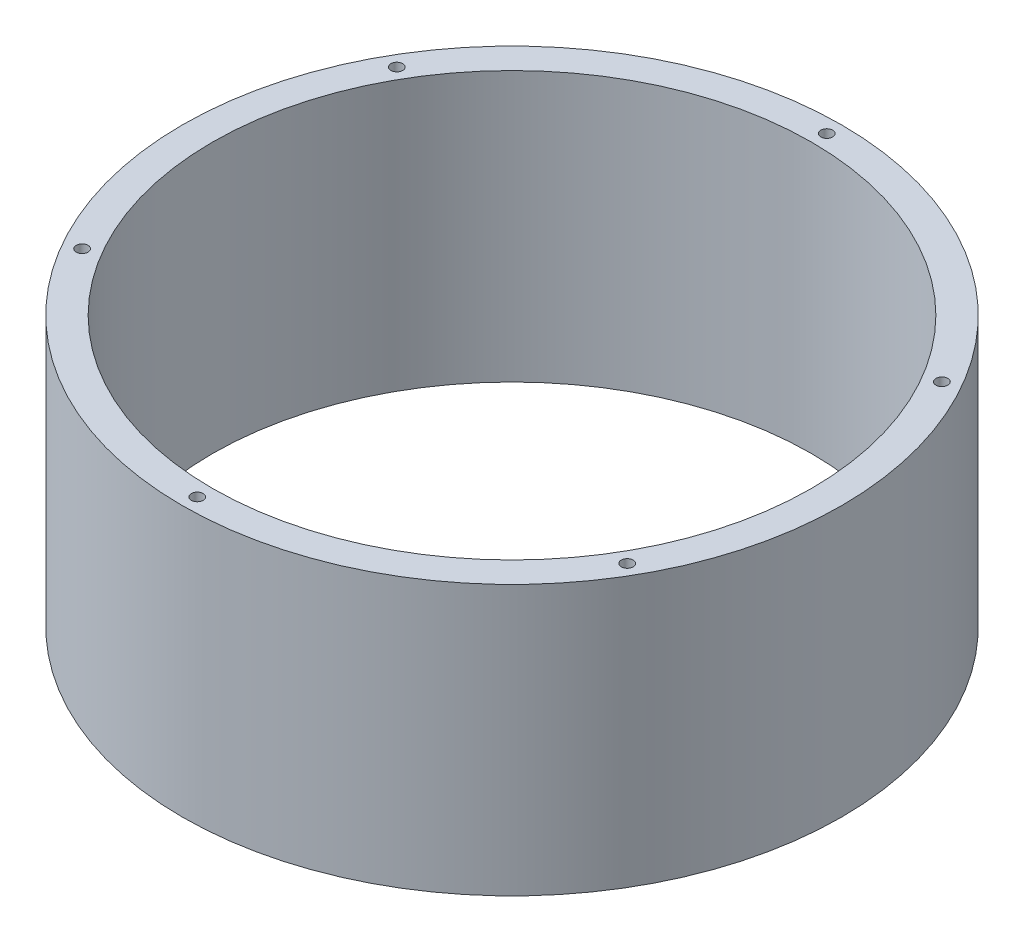
ISO-10303-21;
HEADER;
FILE_DESCRIPTION(('STEP AP214'),'2;1');
FILE_NAME('part.step','',(''),(''),'','','');
FILE_SCHEMA(('AUTOMOTIVE_DESIGN { 1 0 10303 214 1 1 1 1 }'));
ENDSEC;
DATA;
#1=APPLICATION_CONTEXT('core data for automotive mechanical design processes');
#2=APPLICATION_PROTOCOL_DEFINITION('international standard','automotive_design',2000,#1);
#3=PRODUCT_CONTEXT('',#1,'mechanical');
#4=PRODUCT('Part','Part','',(#3));
#5=PRODUCT_RELATED_PRODUCT_CATEGORY('part','',(#4));
#6=PRODUCT_DEFINITION_FORMATION('','',#4);
#7=PRODUCT_DEFINITION_CONTEXT('part definition',#1,'design');
#8=PRODUCT_DEFINITION('design','',#6,#7);
#9=PRODUCT_DEFINITION_SHAPE('','',#8);
#10=(LENGTH_UNIT() NAMED_UNIT(*) SI_UNIT(.MILLI.,.METRE.));
#11=(NAMED_UNIT(*) PLANE_ANGLE_UNIT() SI_UNIT($,.RADIAN.));
#12=(NAMED_UNIT(*) SI_UNIT($,.STERADIAN.) SOLID_ANGLE_UNIT());
#13=UNCERTAINTY_MEASURE_WITH_UNIT(LENGTH_MEASURE(1.E-05),#10,'distance_accuracy_value','');
#14=(GEOMETRIC_REPRESENTATION_CONTEXT(3) GLOBAL_UNCERTAINTY_ASSIGNED_CONTEXT((#13)) GLOBAL_UNIT_ASSIGNED_CONTEXT((#10,
#11,#12)) REPRESENTATION_CONTEXT('',''));
#15=CARTESIAN_POINT('',(0.,0.,0.));
#16=DIRECTION('',(0.,0.,1.));
#17=DIRECTION('',(1.,0.,0.));
#18=AXIS2_PLACEMENT_3D('',#15,#16,#17);
#19=CARTESIAN_POINT('',(0.,57.15,0.));
#20=DIRECTION('',(0.,1.,0.));
#21=DIRECTION('',(0.,0.,1.));
#22=AXIS2_PLACEMENT_3D('',#19,#20,#21);
#23=PLANE('',#22);
#24=CARTESIAN_POINT('',(57.7450316168959,57.15,-33.3326708885396));
#25=DIRECTION('',(0.,1.,0.));
#26=DIRECTION('',(0.,0.,1.));
#27=AXIS2_PLACEMENT_3D('',#24,#25,#26);
#28=CIRCLE('',#27,1.2573);
#29=CARTESIAN_POINT('',(57.7450316168959,57.15,-32.0753708885396));
#30=VERTEX_POINT('',#29);
#31=EDGE_CURVE('E94',#30,#30,#28,.T.);
#32=ORIENTED_EDGE('',*,*,#31,.F.);
#33=EDGE_LOOP('',(#32));
#34=FACE_BOUND('',#33,.T.);
#35=CARTESIAN_POINT('',(57.7394555739092,57.15,33.3423288782978));
#36=DIRECTION('',(0.,1.,0.));
#37=DIRECTION('',(0.,0.,1.));
#38=AXIS2_PLACEMENT_3D('',#35,#36,#37);
#39=CIRCLE('',#38,1.2573);
#40=CARTESIAN_POINT('',(57.7394555739092,57.15,34.5996288782978));
#41=VERTEX_POINT('',#40);
#42=EDGE_CURVE('E106',#41,#41,#39,.T.);
#43=ORIENTED_EDGE('',*,*,#42,.F.);
#44=EDGE_LOOP('',(#43));
#45=FACE_BOUND('',#44,.T.);
#46=CARTESIAN_POINT('',(-0.00557604298697306,57.15,66.6749997668372));
#47=DIRECTION('',(0.,1.,0.));
#48=DIRECTION('',(0.,0.,1.));
#49=AXIS2_PLACEMENT_3D('',#46,#47,#48);
#50=CIRCLE('',#49,1.2573);
#51=CARTESIAN_POINT('',(-0.00557604298697306,57.15,67.9322997668372));
#52=VERTEX_POINT('',#51);
#53=EDGE_CURVE('E118',#52,#52,#50,.T.);
#54=ORIENTED_EDGE('',*,*,#53,.F.);
#55=EDGE_LOOP('',(#54));
#56=FACE_BOUND('',#55,.T.);
#57=CARTESIAN_POINT('',(-57.7450316168961,57.15,33.3326708885392));
#58=DIRECTION('',(0.,1.,0.));
#59=DIRECTION('',(0.,0.,1.));
#60=AXIS2_PLACEMENT_3D('',#57,#58,#59);
#61=CIRCLE('',#60,1.2573);
#62=CARTESIAN_POINT('',(-57.7450316168961,57.15,34.5899708885392));
#63=VERTEX_POINT('',#62);
#64=EDGE_CURVE('E130',#63,#63,#61,.T.);
#65=ORIENTED_EDGE('',*,*,#64,.F.);
#66=EDGE_LOOP('',(#65));
#67=FACE_BOUND('',#66,.T.);
#68=CARTESIAN_POINT('',(-57.7394555739089,57.15,-33.3423288782982));
#69=DIRECTION('',(0.,1.,0.));
#70=DIRECTION('',(0.,0.,1.));
#71=AXIS2_PLACEMENT_3D('',#68,#69,#70);
#72=CIRCLE('',#71,1.2573);
#73=CARTESIAN_POINT('',(-57.7394555739089,57.15,-32.0850288782982));
#74=VERTEX_POINT('',#73);
#75=EDGE_CURVE('E142',#74,#74,#72,.T.);
#76=ORIENTED_EDGE('',*,*,#75,.F.);
#77=EDGE_LOOP('',(#76));
#78=FACE_BOUND('',#77,.T.);
#79=CARTESIAN_POINT('',(0.00557604298743865,57.15,-66.6749997668372));
#80=DIRECTION('',(0.,1.,0.));
#81=DIRECTION('',(0.,0.,1.));
#82=AXIS2_PLACEMENT_3D('',#79,#80,#81);
#83=CIRCLE('',#82,1.2573);
#84=CARTESIAN_POINT('',(0.00557604298743865,57.15,-65.4176997668372));
#85=VERTEX_POINT('',#84);
#86=EDGE_CURVE('E154',#85,#85,#83,.T.);
#87=ORIENTED_EDGE('',*,*,#86,.F.);
#88=EDGE_LOOP('',(#87));
#89=FACE_BOUND('',#88,.T.);
#90=CARTESIAN_POINT('',(0.,57.15,0.));
#91=DIRECTION('',(0.,1.,0.));
#92=DIRECTION('',(0.,0.,1.));
#93=AXIS2_PLACEMENT_3D('',#90,#91,#92);
#94=CIRCLE('',#93,69.85);
#95=CARTESIAN_POINT('',(0.,57.15,69.85));
#96=VERTEX_POINT('',#95);
#97=EDGE_CURVE('E11',#96,#96,#94,.T.);
#98=ORIENTED_EDGE('',*,*,#97,.T.);
#99=EDGE_LOOP('',(#98));
#100=FACE_BOUND('',#99,.T.);
#101=CARTESIAN_POINT('',(0.,57.15,0.));
#102=DIRECTION('',(0.,1.,0.));
#103=DIRECTION('',(0.,0.,1.));
#104=AXIS2_PLACEMENT_3D('',#101,#102,#103);
#105=CIRCLE('',#104,63.5);
#106=CARTESIAN_POINT('',(0.,57.15,63.5));
#107=VERTEX_POINT('',#106);
#108=EDGE_CURVE('E230',#107,#107,#105,.T.);
#109=ORIENTED_EDGE('',*,*,#108,.F.);
#110=EDGE_LOOP('',(#109));
#111=FACE_BOUND('',#110,.T.);
#112=ADVANCED_FACE('F32',(#34,#45,#56,#67,#78,#89,#100,#111),#23,.T.);
#113=CARTESIAN_POINT('',(0.,0.,0.));
#114=DIRECTION('',(0.,1.,0.));
#115=DIRECTION('',(0.,0.,1.));
#116=AXIS2_PLACEMENT_3D('',#113,#114,#115);
#117=PLANE('',#116);
#118=CARTESIAN_POINT('',(-57.7422437973271,0.,33.3375000000007));
#119=DIRECTION('',(0.,-1.,0.));
#120=DIRECTION('',(0.,0.,-1.));
#121=AXIS2_PLACEMENT_3D('',#118,#119,#120);
#122=CIRCLE('',#121,1.2573);
#123=CARTESIAN_POINT('',(-57.7422437973271,0.,32.0802000000007));
#124=VERTEX_POINT('',#123);
#125=EDGE_CURVE('E166',#124,#124,#122,.T.);
#126=ORIENTED_EDGE('',*,*,#125,.F.);
#127=EDGE_LOOP('',(#126));
#128=FACE_BOUND('',#127,.T.);
#129=CARTESIAN_POINT('',(-57.7422437973278,0.,-33.3374999999995));
#130=DIRECTION('',(0.,-1.,0.));
#131=DIRECTION('',(0.,0.,-1.));
#132=AXIS2_PLACEMENT_3D('',#129,#130,#131);
#133=CIRCLE('',#132,1.2573);
#134=CARTESIAN_POINT('',(-57.7422437973278,0.,-34.5947999999995));
#135=VERTEX_POINT('',#134);
#136=EDGE_CURVE('E178',#135,#135,#133,.T.);
#137=ORIENTED_EDGE('',*,*,#136,.F.);
#138=EDGE_LOOP('',(#137));
#139=FACE_BOUND('',#138,.T.);
#140=CARTESIAN_POINT('',(-4.65589306203936E-13,0.,-66.675));
#141=DIRECTION('',(0.,-1.,0.));
#142=DIRECTION('',(0.,0.,-1.));
#143=AXIS2_PLACEMENT_3D('',#140,#141,#142);
#144=CIRCLE('',#143,1.2573);
#145=CARTESIAN_POINT('',(-4.65589306203936E-13,0.,-67.9323));
#146=VERTEX_POINT('',#145);
#147=EDGE_CURVE('E190',#146,#146,#144,.T.);
#148=ORIENTED_EDGE('',*,*,#147,.F.);
#149=EDGE_LOOP('',(#148));
#150=FACE_BOUND('',#149,.T.);
#151=CARTESIAN_POINT('',(57.7422437973273,0.,-33.3375000000003));
#152=DIRECTION('',(0.,-1.,0.));
#153=DIRECTION('',(0.,0.,-1.));
#154=AXIS2_PLACEMENT_3D('',#151,#152,#153);
#155=CIRCLE('',#154,1.2573);
#156=CARTESIAN_POINT('',(57.7422437973273,0.,-34.5948000000003));
#157=VERTEX_POINT('',#156);
#158=EDGE_CURVE('E202',#157,#157,#155,.T.);
#159=ORIENTED_EDGE('',*,*,#158,.F.);
#160=EDGE_LOOP('',(#159));
#161=FACE_BOUND('',#160,.T.);
#162=CARTESIAN_POINT('',(57.7422437973275,0.,33.3374999999999));
#163=DIRECTION('',(0.,-1.,0.));
#164=DIRECTION('',(0.,0.,-1.));
#165=AXIS2_PLACEMENT_3D('',#162,#163,#164);
#166=CIRCLE('',#165,1.2573);
#167=CARTESIAN_POINT('',(57.7422437973275,0.,32.0801999999999));
#168=VERTEX_POINT('',#167);
#169=EDGE_CURVE('E214',#168,#168,#166,.T.);
#170=ORIENTED_EDGE('',*,*,#169,.F.);
#171=EDGE_LOOP('',(#170));
#172=FACE_BOUND('',#171,.T.);
#173=CARTESIAN_POINT('',(0.,0.,66.675));
#174=DIRECTION('',(0.,-1.,0.));
#175=DIRECTION('',(0.,0.,-1.));
#176=AXIS2_PLACEMENT_3D('',#173,#174,#175);
#177=CIRCLE('',#176,1.2573);
#178=CARTESIAN_POINT('',(0.,0.,65.4177));
#179=VERTEX_POINT('',#178);
#180=EDGE_CURVE('E226',#179,#179,#177,.T.);
#181=ORIENTED_EDGE('',*,*,#180,.F.);
#182=EDGE_LOOP('',(#181));
#183=FACE_BOUND('',#182,.T.);
#184=CARTESIAN_POINT('',(0.,0.,0.));
#185=DIRECTION('',(0.,1.,0.));
#186=DIRECTION('',(0.,0.,1.));
#187=AXIS2_PLACEMENT_3D('',#184,#185,#186);
#188=CIRCLE('',#187,69.85);
#189=CARTESIAN_POINT('',(0.,0.,69.85));
#190=VERTEX_POINT('',#189);
#191=EDGE_CURVE('E36',#190,#190,#188,.T.);
#192=ORIENTED_EDGE('',*,*,#191,.F.);
#193=EDGE_LOOP('',(#192));
#194=FACE_BOUND('',#193,.T.);
#195=CARTESIAN_POINT('',(0.,0.,0.));
#196=DIRECTION('',(0.,1.,0.));
#197=DIRECTION('',(0.,0.,1.));
#198=AXIS2_PLACEMENT_3D('',#195,#196,#197);
#199=CIRCLE('',#198,63.5);
#200=CARTESIAN_POINT('',(0.,0.,63.5));
#201=VERTEX_POINT('',#200);
#202=EDGE_CURVE('E229',#201,#201,#199,.T.);
#203=ORIENTED_EDGE('',*,*,#202,.T.);
#204=EDGE_LOOP('',(#203));
#205=FACE_BOUND('',#204,.T.);
#206=ADVANCED_FACE('F236',(#128,#139,#150,#161,#172,#183,#194,#205),#117,.F.);
#207=CARTESIAN_POINT('',(0.,57.15,0.));
#208=DIRECTION('',(0.,-1.,0.));
#209=DIRECTION('',(0.,0.,-1.));
#210=AXIS2_PLACEMENT_3D('',#207,#208,#209);
#211=CYLINDRICAL_SURFACE('',#210,69.85);
#212=ORIENTED_EDGE('',*,*,#97,.F.);
#213=EDGE_LOOP('',(#212));
#214=FACE_BOUND('',#213,.T.);
#215=ORIENTED_EDGE('',*,*,#191,.T.);
#216=EDGE_LOOP('',(#215));
#217=FACE_BOUND('',#216,.T.);
#218=ADVANCED_FACE('F34',(#214,#217),#211,.T.);
#219=CARTESIAN_POINT('',(0.,57.15,0.));
#220=DIRECTION('',(0.,-1.,0.));
#221=DIRECTION('',(0.,0.,-1.));
#222=AXIS2_PLACEMENT_3D('',#219,#220,#221);
#223=CYLINDRICAL_SURFACE('',#222,63.5);
#224=ORIENTED_EDGE('',*,*,#108,.T.);
#225=EDGE_LOOP('',(#224));
#226=FACE_BOUND('',#225,.T.);
#227=ORIENTED_EDGE('',*,*,#202,.F.);
#228=EDGE_LOOP('',(#227));
#229=FACE_BOUND('',#228,.T.);
#230=ADVANCED_FACE('F238',(#226,#229),#223,.F.);
#231=CARTESIAN_POINT('',(0.,0.,66.675));
#232=DIRECTION('',(0.,-1.,0.));
#233=DIRECTION('',(0.,0.,-1.));
#234=AXIS2_PLACEMENT_3D('',#231,#232,#233);
#235=CYLINDRICAL_SURFACE('',#234,1.2573);
#236=CARTESIAN_POINT('',(0.,5.08,66.675));
#237=DIRECTION('',(0.,-1.,0.));
#238=DIRECTION('',(0.,0.,-1.));
#239=AXIS2_PLACEMENT_3D('',#236,#237,#238);
#240=CIRCLE('',#239,1.2573);
#241=CARTESIAN_POINT('',(0.,5.08,65.4177));
#242=VERTEX_POINT('',#241);
#243=EDGE_CURVE('E223',#242,#242,#240,.T.);
#244=ORIENTED_EDGE('',*,*,#243,.F.);
#245=EDGE_LOOP('',(#244));
#246=FACE_BOUND('',#245,.T.);
#247=ORIENTED_EDGE('',*,*,#180,.T.);
#248=EDGE_LOOP('',(#247));
#249=FACE_BOUND('',#248,.T.);
#250=ADVANCED_FACE('F240',(#246,#249),#235,.F.);
#251=CARTESIAN_POINT('',(1.0414,5.08,66.675));
#252=DIRECTION('',(0.,1.,0.));
#253=DIRECTION('',(0.,0.,1.));
#254=AXIS2_PLACEMENT_3D('',#251,#252,#253);
#255=PLANE('',#254);
#256=CARTESIAN_POINT('',(0.,5.08,66.675));
#257=DIRECTION('',(0.,-1.,0.));
#258=DIRECTION('',(0.,0.,-1.));
#259=AXIS2_PLACEMENT_3D('',#256,#257,#258);
#260=CIRCLE('',#259,1.0414);
#261=CARTESIAN_POINT('',(0.,5.08,65.6336));
#262=VERTEX_POINT('',#261);
#263=EDGE_CURVE('E220',#262,#262,#260,.T.);
#264=ORIENTED_EDGE('',*,*,#263,.F.);
#265=EDGE_LOOP('',(#264));
#266=FACE_BOUND('',#265,.T.);
#267=ORIENTED_EDGE('',*,*,#243,.T.);
#268=EDGE_LOOP('',(#267));
#269=FACE_BOUND('',#268,.T.);
#270=ADVANCED_FACE('F247',(#266,#269),#255,.F.);
#271=CARTESIAN_POINT('',(0.,0.,66.675));
#272=DIRECTION('',(0.,-1.,0.));
#273=DIRECTION('',(0.,0.,-1.));
#274=AXIS2_PLACEMENT_3D('',#271,#272,#273);
#275=CYLINDRICAL_SURFACE('',#274,1.0414);
#276=CARTESIAN_POINT('',(0.,6.35,66.675));
#277=DIRECTION('',(0.,-1.,0.));
#278=DIRECTION('',(0.,0.,-1.));
#279=AXIS2_PLACEMENT_3D('',#276,#277,#278);
#280=CIRCLE('',#279,1.0414);
#281=CARTESIAN_POINT('',(0.,6.35,65.6336));
#282=VERTEX_POINT('',#281);
#283=EDGE_CURVE('E217',#282,#282,#280,.T.);
#284=ORIENTED_EDGE('',*,*,#283,.F.);
#285=EDGE_LOOP('',(#284));
#286=FACE_BOUND('',#285,.T.);
#287=ORIENTED_EDGE('',*,*,#263,.T.);
#288=EDGE_LOOP('',(#287));
#289=FACE_BOUND('',#288,.T.);
#290=ADVANCED_FACE('F374',(#286,#289),#275,.F.);
#291=CARTESIAN_POINT('',(0.,6.35,66.675));
#292=DIRECTION('',(0.,-1.,0.));
#293=DIRECTION('',(0.,0.,-1.));
#294=AXIS2_PLACEMENT_3D('',#291,#292,#293);
#295=CONICAL_SURFACE('',#294,1.0414,1.02974425867665);
#296=CARTESIAN_POINT('',(0.,6.9757362486553,66.675));
#297=VERTEX_POINT('',#296);
#298=VERTEX_LOOP('',#297);
#299=FACE_BOUND('',#298,.T.);
#300=ORIENTED_EDGE('',*,*,#283,.T.);
#301=EDGE_LOOP('',(#300));
#302=FACE_BOUND('',#301,.T.);
#303=ADVANCED_FACE('F370',(#299,#302),#295,.F.);
#304=CARTESIAN_POINT('',(57.7422437973275,0.,33.3374999999999));
#305=DIRECTION('',(0.,-1.,0.));
#306=DIRECTION('',(0.,0.,-1.));
#307=AXIS2_PLACEMENT_3D('',#304,#305,#306);
#308=CYLINDRICAL_SURFACE('',#307,1.2573);
#309=CARTESIAN_POINT('',(57.7422437973275,5.08,33.3374999999999));
#310=DIRECTION('',(0.,-1.,0.));
#311=DIRECTION('',(0.,0.,-1.));
#312=AXIS2_PLACEMENT_3D('',#309,#310,#311);
#313=CIRCLE('',#312,1.2573);
#314=CARTESIAN_POINT('',(57.7422437973275,5.08,32.0801999999999));
#315=VERTEX_POINT('',#314);
#316=EDGE_CURVE('E211',#315,#315,#313,.T.);
#317=ORIENTED_EDGE('',*,*,#316,.F.);
#318=EDGE_LOOP('',(#317));
#319=FACE_BOUND('',#318,.T.);
#320=ORIENTED_EDGE('',*,*,#169,.T.);
#321=EDGE_LOOP('',(#320));
#322=FACE_BOUND('',#321,.T.);
#323=ADVANCED_FACE('F366',(#319,#322),#308,.F.);
#324=CARTESIAN_POINT('',(58.7836437973275,5.08,33.3374999999999));
#325=DIRECTION('',(0.,1.,0.));
#326=DIRECTION('',(0.,0.,1.));
#327=AXIS2_PLACEMENT_3D('',#324,#325,#326);
#328=PLANE('',#327);
#329=CARTESIAN_POINT('',(57.7422437973275,5.08,33.3374999999999));
#330=DIRECTION('',(0.,-1.,0.));
#331=DIRECTION('',(0.,0.,-1.));
#332=AXIS2_PLACEMENT_3D('',#329,#330,#331);
#333=CIRCLE('',#332,1.0414);
#334=CARTESIAN_POINT('',(57.7422437973275,5.08,32.2960999999999));
#335=VERTEX_POINT('',#334);
#336=EDGE_CURVE('E208',#335,#335,#333,.T.);
#337=ORIENTED_EDGE('',*,*,#336,.F.);
#338=EDGE_LOOP('',(#337));
#339=FACE_BOUND('',#338,.T.);
#340=ORIENTED_EDGE('',*,*,#316,.T.);
#341=EDGE_LOOP('',(#340));
#342=FACE_BOUND('',#341,.T.);
#343=ADVANCED_FACE('F362',(#339,#342),#328,.F.);
#344=CARTESIAN_POINT('',(57.7422437973275,0.,33.3374999999999));
#345=DIRECTION('',(0.,-1.,0.));
#346=DIRECTION('',(0.,0.,-1.));
#347=AXIS2_PLACEMENT_3D('',#344,#345,#346);
#348=CYLINDRICAL_SURFACE('',#347,1.0414);
#349=CARTESIAN_POINT('',(57.7422437973275,6.35,33.3374999999999));
#350=DIRECTION('',(0.,-1.,0.));
#351=DIRECTION('',(0.,0.,-1.));
#352=AXIS2_PLACEMENT_3D('',#349,#350,#351);
#353=CIRCLE('',#352,1.0414);
#354=CARTESIAN_POINT('',(57.7422437973275,6.35,32.2960999999999));
#355=VERTEX_POINT('',#354);
#356=EDGE_CURVE('E205',#355,#355,#353,.T.);
#357=ORIENTED_EDGE('',*,*,#356,.F.);
#358=EDGE_LOOP('',(#357));
#359=FACE_BOUND('',#358,.T.);
#360=ORIENTED_EDGE('',*,*,#336,.T.);
#361=EDGE_LOOP('',(#360));
#362=FACE_BOUND('',#361,.T.);
#363=ADVANCED_FACE('F359',(#359,#362),#348,.F.);
#364=CARTESIAN_POINT('',(57.7422437973275,6.35,33.3374999999999));
#365=DIRECTION('',(0.,-1.,0.));
#366=DIRECTION('',(0.,0.,-1.));
#367=AXIS2_PLACEMENT_3D('',#364,#365,#366);
#368=CONICAL_SURFACE('',#367,1.0414,1.02974425867665);
#369=CARTESIAN_POINT('',(57.7422437973275,6.9757362486553,33.3374999999999));
#370=VERTEX_POINT('',#369);
#371=VERTEX_LOOP('',#370);
#372=FACE_BOUND('',#371,.T.);
#373=ORIENTED_EDGE('',*,*,#356,.T.);
#374=EDGE_LOOP('',(#373));
#375=FACE_BOUND('',#374,.T.);
#376=ADVANCED_FACE('F355',(#372,#375),#368,.F.);
#377=CARTESIAN_POINT('',(57.7422437973273,0.,-33.3375000000003));
#378=DIRECTION('',(0.,-1.,0.));
#379=DIRECTION('',(0.,0.,-1.));
#380=AXIS2_PLACEMENT_3D('',#377,#378,#379);
#381=CYLINDRICAL_SURFACE('',#380,1.2573);
#382=CARTESIAN_POINT('',(57.7422437973273,5.08,-33.3375000000003));
#383=DIRECTION('',(0.,-1.,0.));
#384=DIRECTION('',(0.,0.,-1.));
#385=AXIS2_PLACEMENT_3D('',#382,#383,#384);
#386=CIRCLE('',#385,1.2573);
#387=CARTESIAN_POINT('',(57.7422437973273,5.08,-34.5948000000003));
#388=VERTEX_POINT('',#387);
#389=EDGE_CURVE('E199',#388,#388,#386,.T.);
#390=ORIENTED_EDGE('',*,*,#389,.F.);
#391=EDGE_LOOP('',(#390));
#392=FACE_BOUND('',#391,.T.);
#393=ORIENTED_EDGE('',*,*,#158,.T.);
#394=EDGE_LOOP('',(#393));
#395=FACE_BOUND('',#394,.T.);
#396=ADVANCED_FACE('F351',(#392,#395),#381,.F.);
#397=CARTESIAN_POINT('',(58.7836437973273,5.08,-33.3375000000003));
#398=DIRECTION('',(0.,1.,0.));
#399=DIRECTION('',(0.,0.,1.));
#400=AXIS2_PLACEMENT_3D('',#397,#398,#399);
#401=PLANE('',#400);
#402=CARTESIAN_POINT('',(57.7422437973273,5.08,-33.3375000000003));
#403=DIRECTION('',(0.,-1.,0.));
#404=DIRECTION('',(0.,0.,-1.));
#405=AXIS2_PLACEMENT_3D('',#402,#403,#404);
#406=CIRCLE('',#405,1.0414);
#407=CARTESIAN_POINT('',(57.7422437973273,5.08,-34.3789000000003));
#408=VERTEX_POINT('',#407);
#409=EDGE_CURVE('E196',#408,#408,#406,.T.);
#410=ORIENTED_EDGE('',*,*,#409,.F.);
#411=EDGE_LOOP('',(#410));
#412=FACE_BOUND('',#411,.T.);
#413=ORIENTED_EDGE('',*,*,#389,.T.);
#414=EDGE_LOOP('',(#413));
#415=FACE_BOUND('',#414,.T.);
#416=ADVANCED_FACE('F347',(#412,#415),#401,.F.);
#417=CARTESIAN_POINT('',(57.7422437973273,0.,-33.3375000000003));
#418=DIRECTION('',(0.,-1.,0.));
#419=DIRECTION('',(0.,0.,-1.));
#420=AXIS2_PLACEMENT_3D('',#417,#418,#419);
#421=CYLINDRICAL_SURFACE('',#420,1.0414);
#422=CARTESIAN_POINT('',(57.7422437973273,6.35,-33.3375000000003));
#423=DIRECTION('',(0.,-1.,0.));
#424=DIRECTION('',(0.,0.,-1.));
#425=AXIS2_PLACEMENT_3D('',#422,#423,#424);
#426=CIRCLE('',#425,1.0414);
#427=CARTESIAN_POINT('',(57.7422437973273,6.35,-34.3789000000003));
#428=VERTEX_POINT('',#427);
#429=EDGE_CURVE('E193',#428,#428,#426,.T.);
#430=ORIENTED_EDGE('',*,*,#429,.F.);
#431=EDGE_LOOP('',(#430));
#432=FACE_BOUND('',#431,.T.);
#433=ORIENTED_EDGE('',*,*,#409,.T.);
#434=EDGE_LOOP('',(#433));
#435=FACE_BOUND('',#434,.T.);
#436=ADVANCED_FACE('F343',(#432,#435),#421,.F.);
#437=CARTESIAN_POINT('',(57.7422437973273,6.35,-33.3375000000003));
#438=DIRECTION('',(0.,-1.,0.));
#439=DIRECTION('',(0.,0.,-1.));
#440=AXIS2_PLACEMENT_3D('',#437,#438,#439);
#441=CONICAL_SURFACE('',#440,1.0414,1.02974425867665);
#442=CARTESIAN_POINT('',(57.7422437973273,6.9757362486553,-33.3375000000003));
#443=VERTEX_POINT('',#442);
#444=VERTEX_LOOP('',#443);
#445=FACE_BOUND('',#444,.T.);
#446=ORIENTED_EDGE('',*,*,#429,.T.);
#447=EDGE_LOOP('',(#446));
#448=FACE_BOUND('',#447,.T.);
#449=ADVANCED_FACE('F339',(#445,#448),#441,.F.);
#450=CARTESIAN_POINT('',(-4.65589306203936E-13,0.,-66.675));
#451=DIRECTION('',(0.,-1.,0.));
#452=DIRECTION('',(0.,0.,-1.));
#453=AXIS2_PLACEMENT_3D('',#450,#451,#452);
#454=CYLINDRICAL_SURFACE('',#453,1.2573);
#455=CARTESIAN_POINT('',(-4.65589306203936E-13,5.08,-66.675));
#456=DIRECTION('',(0.,-1.,0.));
#457=DIRECTION('',(0.,0.,-1.));
#458=AXIS2_PLACEMENT_3D('',#455,#456,#457);
#459=CIRCLE('',#458,1.2573);
#460=CARTESIAN_POINT('',(-4.65589306203936E-13,5.08,-67.9323));
#461=VERTEX_POINT('',#460);
#462=EDGE_CURVE('E187',#461,#461,#459,.T.);
#463=ORIENTED_EDGE('',*,*,#462,.F.);
#464=EDGE_LOOP('',(#463));
#465=FACE_BOUND('',#464,.T.);
#466=ORIENTED_EDGE('',*,*,#147,.T.);
#467=EDGE_LOOP('',(#466));
#468=FACE_BOUND('',#467,.T.);
#469=ADVANCED_FACE('F335',(#465,#468),#454,.F.);
#470=CARTESIAN_POINT('',(1.04139999999953,5.08,-66.675));
#471=DIRECTION('',(0.,1.,0.));
#472=DIRECTION('',(0.,0.,1.));
#473=AXIS2_PLACEMENT_3D('',#470,#471,#472);
#474=PLANE('',#473);
#475=CARTESIAN_POINT('',(-4.65589306203936E-13,5.08,-66.675));
#476=DIRECTION('',(0.,-1.,0.));
#477=DIRECTION('',(0.,0.,-1.));
#478=AXIS2_PLACEMENT_3D('',#475,#476,#477);
#479=CIRCLE('',#478,1.0414);
#480=CARTESIAN_POINT('',(-4.65589306203936E-13,5.08,-67.7164));
#481=VERTEX_POINT('',#480);
#482=EDGE_CURVE('E184',#481,#481,#479,.T.);
#483=ORIENTED_EDGE('',*,*,#482,.F.);
#484=EDGE_LOOP('',(#483));
#485=FACE_BOUND('',#484,.T.);
#486=ORIENTED_EDGE('',*,*,#462,.T.);
#487=EDGE_LOOP('',(#486));
#488=FACE_BOUND('',#487,.T.);
#489=ADVANCED_FACE('F331',(#485,#488),#474,.F.);
#490=CARTESIAN_POINT('',(-4.65589306203936E-13,0.,-66.675));
#491=DIRECTION('',(0.,-1.,0.));
#492=DIRECTION('',(0.,0.,-1.));
#493=AXIS2_PLACEMENT_3D('',#490,#491,#492);
#494=CYLINDRICAL_SURFACE('',#493,1.0414);
#495=CARTESIAN_POINT('',(-4.65589306203936E-13,6.35,-66.675));
#496=DIRECTION('',(0.,-1.,0.));
#497=DIRECTION('',(0.,0.,-1.));
#498=AXIS2_PLACEMENT_3D('',#495,#496,#497);
#499=CIRCLE('',#498,1.0414);
#500=CARTESIAN_POINT('',(-4.65589306203936E-13,6.35,-67.7164));
#501=VERTEX_POINT('',#500);
#502=EDGE_CURVE('E181',#501,#501,#499,.T.);
#503=ORIENTED_EDGE('',*,*,#502,.F.);
#504=EDGE_LOOP('',(#503));
#505=FACE_BOUND('',#504,.T.);
#506=ORIENTED_EDGE('',*,*,#482,.T.);
#507=EDGE_LOOP('',(#506));
#508=FACE_BOUND('',#507,.T.);
#509=ADVANCED_FACE('F327',(#505,#508),#494,.F.);
#510=CARTESIAN_POINT('',(-4.65589306203936E-13,6.35,-66.675));
#511=DIRECTION('',(0.,-1.,0.));
#512=DIRECTION('',(0.,0.,-1.));
#513=AXIS2_PLACEMENT_3D('',#510,#511,#512);
#514=CONICAL_SURFACE('',#513,1.0414,1.02974425867665);
#515=CARTESIAN_POINT('',(-4.67293671377316E-13,6.9757362486553,-66.675));
#516=VERTEX_POINT('',#515);
#517=VERTEX_LOOP('',#516);
#518=FACE_BOUND('',#517,.T.);
#519=ORIENTED_EDGE('',*,*,#502,.T.);
#520=EDGE_LOOP('',(#519));
#521=FACE_BOUND('',#520,.T.);
#522=ADVANCED_FACE('F323',(#518,#521),#514,.F.);
#523=CARTESIAN_POINT('',(-57.7422437973278,0.,-33.3374999999995));
#524=DIRECTION('',(0.,-1.,0.));
#525=DIRECTION('',(0.,0.,-1.));
#526=AXIS2_PLACEMENT_3D('',#523,#524,#525);
#527=CYLINDRICAL_SURFACE('',#526,1.2573);
#528=CARTESIAN_POINT('',(-57.7422437973278,5.08,-33.3374999999995));
#529=DIRECTION('',(0.,-1.,0.));
#530=DIRECTION('',(0.,0.,-1.));
#531=AXIS2_PLACEMENT_3D('',#528,#529,#530);
#532=CIRCLE('',#531,1.2573);
#533=CARTESIAN_POINT('',(-57.7422437973278,5.08,-34.5947999999995));
#534=VERTEX_POINT('',#533);
#535=EDGE_CURVE('E175',#534,#534,#532,.T.);
#536=ORIENTED_EDGE('',*,*,#535,.F.);
#537=EDGE_LOOP('',(#536));
#538=FACE_BOUND('',#537,.T.);
#539=ORIENTED_EDGE('',*,*,#136,.T.);
#540=EDGE_LOOP('',(#539));
#541=FACE_BOUND('',#540,.T.);
#542=ADVANCED_FACE('F319',(#538,#541),#527,.F.);
#543=CARTESIAN_POINT('',(-56.7008437973278,5.08,-33.3374999999995));
#544=DIRECTION('',(0.,1.,0.));
#545=DIRECTION('',(0.,0.,1.));
#546=AXIS2_PLACEMENT_3D('',#543,#544,#545);
#547=PLANE('',#546);
#548=CARTESIAN_POINT('',(-57.7422437973278,5.08,-33.3374999999995));
#549=DIRECTION('',(0.,-1.,0.));
#550=DIRECTION('',(0.,0.,-1.));
#551=AXIS2_PLACEMENT_3D('',#548,#549,#550);
#552=CIRCLE('',#551,1.0414);
#553=CARTESIAN_POINT('',(-57.7422437973278,5.08,-34.3788999999995));
#554=VERTEX_POINT('',#553);
#555=EDGE_CURVE('E172',#554,#554,#552,.T.);
#556=ORIENTED_EDGE('',*,*,#555,.F.);
#557=EDGE_LOOP('',(#556));
#558=FACE_BOUND('',#557,.T.);
#559=ORIENTED_EDGE('',*,*,#535,.T.);
#560=EDGE_LOOP('',(#559));
#561=FACE_BOUND('',#560,.T.);
#562=ADVANCED_FACE('F315',(#558,#561),#547,.F.);
#563=CARTESIAN_POINT('',(-57.7422437973278,0.,-33.3374999999995));
#564=DIRECTION('',(0.,-1.,0.));
#565=DIRECTION('',(0.,0.,-1.));
#566=AXIS2_PLACEMENT_3D('',#563,#564,#565);
#567=CYLINDRICAL_SURFACE('',#566,1.0414);
#568=CARTESIAN_POINT('',(-57.7422437973278,6.35,-33.3374999999995));
#569=DIRECTION('',(0.,-1.,0.));
#570=DIRECTION('',(0.,0.,-1.));
#571=AXIS2_PLACEMENT_3D('',#568,#569,#570);
#572=CIRCLE('',#571,1.0414);
#573=CARTESIAN_POINT('',(-57.7422437973278,6.35,-34.3788999999995));
#574=VERTEX_POINT('',#573);
#575=EDGE_CURVE('E169',#574,#574,#572,.T.);
#576=ORIENTED_EDGE('',*,*,#575,.F.);
#577=EDGE_LOOP('',(#576));
#578=FACE_BOUND('',#577,.T.);
#579=ORIENTED_EDGE('',*,*,#555,.T.);
#580=EDGE_LOOP('',(#579));
#581=FACE_BOUND('',#580,.T.);
#582=ADVANCED_FACE('F311',(#578,#581),#567,.F.);
#583=CARTESIAN_POINT('',(-57.7422437973278,6.35,-33.3374999999995));
#584=DIRECTION('',(0.,-1.,0.));
#585=DIRECTION('',(0.,0.,-1.));
#586=AXIS2_PLACEMENT_3D('',#583,#584,#585);
#587=CONICAL_SURFACE('',#586,1.0414,1.02974425867665);
#588=CARTESIAN_POINT('',(-57.7422437973278,6.9757362486553,-33.3374999999995));
#589=VERTEX_POINT('',#588);
#590=VERTEX_LOOP('',#589);
#591=FACE_BOUND('',#590,.T.);
#592=ORIENTED_EDGE('',*,*,#575,.T.);
#593=EDGE_LOOP('',(#592));
#594=FACE_BOUND('',#593,.T.);
#595=ADVANCED_FACE('F307',(#591,#594),#587,.F.);
#596=CARTESIAN_POINT('',(-57.7422437973271,0.,33.3375000000007));
#597=DIRECTION('',(0.,-1.,0.));
#598=DIRECTION('',(0.,0.,-1.));
#599=AXIS2_PLACEMENT_3D('',#596,#597,#598);
#600=CYLINDRICAL_SURFACE('',#599,1.2573);
#601=CARTESIAN_POINT('',(-57.7422437973271,5.08,33.3375000000007));
#602=DIRECTION('',(0.,-1.,0.));
#603=DIRECTION('',(0.,0.,-1.));
#604=AXIS2_PLACEMENT_3D('',#601,#602,#603);
#605=CIRCLE('',#604,1.2573);
#606=CARTESIAN_POINT('',(-57.7422437973271,5.08,32.0802000000007));
#607=VERTEX_POINT('',#606);
#608=EDGE_CURVE('E163',#607,#607,#605,.T.);
#609=ORIENTED_EDGE('',*,*,#608,.F.);
#610=EDGE_LOOP('',(#609));
#611=FACE_BOUND('',#610,.T.);
#612=ORIENTED_EDGE('',*,*,#125,.T.);
#613=EDGE_LOOP('',(#612));
#614=FACE_BOUND('',#613,.T.);
#615=ADVANCED_FACE('F303',(#611,#614),#600,.F.);
#616=CARTESIAN_POINT('',(-56.7008437973271,5.08,33.3375000000007));
#617=DIRECTION('',(0.,1.,0.));
#618=DIRECTION('',(0.,0.,1.));
#619=AXIS2_PLACEMENT_3D('',#616,#617,#618);
#620=PLANE('',#619);
#621=CARTESIAN_POINT('',(-57.7422437973271,5.08,33.3375000000007));
#622=DIRECTION('',(0.,-1.,0.));
#623=DIRECTION('',(0.,0.,-1.));
#624=AXIS2_PLACEMENT_3D('',#621,#622,#623);
#625=CIRCLE('',#624,1.0414);
#626=CARTESIAN_POINT('',(-57.7422437973271,5.08,32.2961000000007));
#627=VERTEX_POINT('',#626);
#628=EDGE_CURVE('E160',#627,#627,#625,.T.);
#629=ORIENTED_EDGE('',*,*,#628,.F.);
#630=EDGE_LOOP('',(#629));
#631=FACE_BOUND('',#630,.T.);
#632=ORIENTED_EDGE('',*,*,#608,.T.);
#633=EDGE_LOOP('',(#632));
#634=FACE_BOUND('',#633,.T.);
#635=ADVANCED_FACE('F299',(#631,#634),#620,.F.);
#636=CARTESIAN_POINT('',(-57.7422437973271,0.,33.3375000000007));
#637=DIRECTION('',(0.,-1.,0.));
#638=DIRECTION('',(0.,0.,-1.));
#639=AXIS2_PLACEMENT_3D('',#636,#637,#638);
#640=CYLINDRICAL_SURFACE('',#639,1.0414);
#641=CARTESIAN_POINT('',(-57.7422437973271,6.35,33.3375000000007));
#642=DIRECTION('',(0.,-1.,0.));
#643=DIRECTION('',(0.,0.,-1.));
#644=AXIS2_PLACEMENT_3D('',#641,#642,#643);
#645=CIRCLE('',#644,1.0414);
#646=CARTESIAN_POINT('',(-57.7422437973271,6.35,32.2961000000007));
#647=VERTEX_POINT('',#646);
#648=EDGE_CURVE('E157',#647,#647,#645,.T.);
#649=ORIENTED_EDGE('',*,*,#648,.F.);
#650=EDGE_LOOP('',(#649));
#651=FACE_BOUND('',#650,.T.);
#652=ORIENTED_EDGE('',*,*,#628,.T.);
#653=EDGE_LOOP('',(#652));
#654=FACE_BOUND('',#653,.T.);
#655=ADVANCED_FACE('F291',(#651,#654),#640,.F.);
#656=CARTESIAN_POINT('',(-57.7422437973271,6.35,33.3375000000007));
#657=DIRECTION('',(0.,-1.,0.));
#658=DIRECTION('',(0.,0.,-1.));
#659=AXIS2_PLACEMENT_3D('',#656,#657,#658);
#660=CONICAL_SURFACE('',#659,1.0414,1.02974425867665);
#661=CARTESIAN_POINT('',(-57.7422437973271,6.9757362486553,33.3375000000007));
#662=VERTEX_POINT('',#661);
#663=VERTEX_LOOP('',#662);
#664=FACE_BOUND('',#663,.T.);
#665=ORIENTED_EDGE('',*,*,#648,.T.);
#666=EDGE_LOOP('',(#665));
#667=FACE_BOUND('',#666,.T.);
#668=ADVANCED_FACE('F281',(#664,#667),#660,.F.);
#669=CARTESIAN_POINT('',(0.00557604298743865,57.15,-66.6749997668372));
#670=DIRECTION('',(0.,1.,0.));
#671=DIRECTION('',(0.,0.,1.));
#672=AXIS2_PLACEMENT_3D('',#669,#670,#671);
#673=CYLINDRICAL_SURFACE('',#672,1.2573);
#674=CARTESIAN_POINT('',(0.00557604298743865,52.1208,-66.6749997668372));
#675=DIRECTION('',(0.,1.,0.));
#676=DIRECTION('',(0.,0.,1.));
#677=AXIS2_PLACEMENT_3D('',#674,#675,#676);
#678=CIRCLE('',#677,1.2573);
#679=CARTESIAN_POINT('',(0.00557604298743865,52.1208,-65.4176997668372));
#680=VERTEX_POINT('',#679);
#681=EDGE_CURVE('E151',#680,#680,#678,.T.);
#682=ORIENTED_EDGE('',*,*,#681,.F.);
#683=EDGE_LOOP('',(#682));
#684=FACE_BOUND('',#683,.T.);
#685=ORIENTED_EDGE('',*,*,#86,.T.);
#686=EDGE_LOOP('',(#685));
#687=FACE_BOUND('',#686,.T.);
#688=ADVANCED_FACE('F278',(#684,#687),#673,.F.);
#689=CARTESIAN_POINT('',(1.04697604298744,52.1208,-66.6749997668372));
#690=DIRECTION('',(0.,-1.,0.));
#691=DIRECTION('',(0.,0.,-1.));
#692=AXIS2_PLACEMENT_3D('',#689,#690,#691);
#693=PLANE('',#692);
#694=CARTESIAN_POINT('',(0.00557604298743865,52.1208,-66.6749997668372));
#695=DIRECTION('',(0.,1.,0.));
#696=DIRECTION('',(0.,0.,1.));
#697=AXIS2_PLACEMENT_3D('',#694,#695,#696);
#698=CIRCLE('',#697,1.0414);
#699=CARTESIAN_POINT('',(0.00557604298743865,52.1208,-65.6335997668372));
#700=VERTEX_POINT('',#699);
#701=EDGE_CURVE('E148',#700,#700,#698,.T.);
#702=ORIENTED_EDGE('',*,*,#701,.F.);
#703=EDGE_LOOP('',(#702));
#704=FACE_BOUND('',#703,.T.);
#705=ORIENTED_EDGE('',*,*,#681,.T.);
#706=EDGE_LOOP('',(#705));
#707=FACE_BOUND('',#706,.T.);
#708=ADVANCED_FACE('F280',(#704,#707),#693,.F.);
#709=CARTESIAN_POINT('',(0.00557604298743865,57.15,-66.6749997668372));
#710=DIRECTION('',(0.,1.,0.));
#711=DIRECTION('',(0.,0.,1.));
#712=AXIS2_PLACEMENT_3D('',#709,#710,#711);
#713=CYLINDRICAL_SURFACE('',#712,1.0414);
#714=CARTESIAN_POINT('',(0.00557604298743865,50.7492,-66.6749997668372));
#715=DIRECTION('',(0.,1.,0.));
#716=DIRECTION('',(0.,0.,1.));
#717=AXIS2_PLACEMENT_3D('',#714,#715,#716);
#718=CIRCLE('',#717,1.0414);
#719=CARTESIAN_POINT('',(0.00557604298743865,50.7492,-65.6335997668372));
#720=VERTEX_POINT('',#719);
#721=EDGE_CURVE('E145',#720,#720,#718,.T.);
#722=ORIENTED_EDGE('',*,*,#721,.F.);
#723=EDGE_LOOP('',(#722));
#724=FACE_BOUND('',#723,.T.);
#725=ORIENTED_EDGE('',*,*,#701,.T.);
#726=EDGE_LOOP('',(#725));
#727=FACE_BOUND('',#726,.T.);
#728=ADVANCED_FACE('F288',(#724,#727),#713,.F.);
#729=CARTESIAN_POINT('',(0.00557604298743865,50.7492,-66.6749997668372));
#730=DIRECTION('',(0.,1.,0.));
#731=DIRECTION('',(0.,0.,1.));
#732=AXIS2_PLACEMENT_3D('',#729,#730,#731);
#733=CONICAL_SURFACE('',#732,1.0414,1.02974425867665);
#734=CARTESIAN_POINT('',(0.00557604298743693,50.1234637513447,-66.6749997668372));
#735=VERTEX_POINT('',#734);
#736=VERTEX_LOOP('',#735);
#737=FACE_BOUND('',#736,.T.);
#738=ORIENTED_EDGE('',*,*,#721,.T.);
#739=EDGE_LOOP('',(#738));
#740=FACE_BOUND('',#739,.T.);
#741=ADVANCED_FACE('F499',(#737,#740),#733,.F.);
#742=CARTESIAN_POINT('',(-57.7394555739089,57.15,-33.3423288782982));
#743=DIRECTION('',(0.,1.,0.));
#744=DIRECTION('',(0.,0.,1.));
#745=AXIS2_PLACEMENT_3D('',#742,#743,#744);
#746=CYLINDRICAL_SURFACE('',#745,1.2573);
#747=CARTESIAN_POINT('',(-57.7394555739089,52.1208,-33.3423288782982));
#748=DIRECTION('',(0.,1.,0.));
#749=DIRECTION('',(0.,0.,1.));
#750=AXIS2_PLACEMENT_3D('',#747,#748,#749);
#751=CIRCLE('',#750,1.2573);
#752=CARTESIAN_POINT('',(-57.7394555739089,52.1208,-32.0850288782982));
#753=VERTEX_POINT('',#752);
#754=EDGE_CURVE('E139',#753,#753,#751,.T.);
#755=ORIENTED_EDGE('',*,*,#754,.F.);
#756=EDGE_LOOP('',(#755));
#757=FACE_BOUND('',#756,.T.);
#758=ORIENTED_EDGE('',*,*,#75,.T.);
#759=EDGE_LOOP('',(#758));
#760=FACE_BOUND('',#759,.T.);
#761=ADVANCED_FACE('F507',(#757,#760),#746,.F.);
#762=CARTESIAN_POINT('',(-56.6980555739089,52.1208,-33.3423288782982));
#763=DIRECTION('',(0.,-1.,0.));
#764=DIRECTION('',(0.,0.,-1.));
#765=AXIS2_PLACEMENT_3D('',#762,#763,#764);
#766=PLANE('',#765);
#767=CARTESIAN_POINT('',(-57.7394555739089,52.1208,-33.3423288782982));
#768=DIRECTION('',(0.,1.,0.));
#769=DIRECTION('',(0.,0.,1.));
#770=AXIS2_PLACEMENT_3D('',#767,#768,#769);
#771=CIRCLE('',#770,1.0414);
#772=CARTESIAN_POINT('',(-57.7394555739089,52.1208,-32.3009288782982));
#773=VERTEX_POINT('',#772);
#774=EDGE_CURVE('E136',#773,#773,#771,.T.);
#775=ORIENTED_EDGE('',*,*,#774,.F.);
#776=EDGE_LOOP('',(#775));
#777=FACE_BOUND('',#776,.T.);
#778=ORIENTED_EDGE('',*,*,#754,.T.);
#779=EDGE_LOOP('',(#778));
#780=FACE_BOUND('',#779,.T.);
#781=ADVANCED_FACE('F523',(#777,#780),#766,.F.);
#782=CARTESIAN_POINT('',(-57.7394555739089,57.15,-33.3423288782982));
#783=DIRECTION('',(0.,1.,0.));
#784=DIRECTION('',(0.,0.,1.));
#785=AXIS2_PLACEMENT_3D('',#782,#783,#784);
#786=CYLINDRICAL_SURFACE('',#785,1.0414);
#787=CARTESIAN_POINT('',(-57.7394555739089,50.7492,-33.3423288782982));
#788=DIRECTION('',(0.,1.,0.));
#789=DIRECTION('',(0.,0.,1.));
#790=AXIS2_PLACEMENT_3D('',#787,#788,#789);
#791=CIRCLE('',#790,1.0414);
#792=CARTESIAN_POINT('',(-57.7394555739089,50.7492,-32.3009288782982));
#793=VERTEX_POINT('',#792);
#794=EDGE_CURVE('E133',#793,#793,#791,.T.);
#795=ORIENTED_EDGE('',*,*,#794,.F.);
#796=EDGE_LOOP('',(#795));
#797=FACE_BOUND('',#796,.T.);
#798=ORIENTED_EDGE('',*,*,#774,.T.);
#799=EDGE_LOOP('',(#798));
#800=FACE_BOUND('',#799,.T.);
#801=ADVANCED_FACE('F533',(#797,#800),#786,.F.);
#802=CARTESIAN_POINT('',(-57.7394555739089,50.7492,-33.3423288782982));
#803=DIRECTION('',(0.,1.,0.));
#804=DIRECTION('',(0.,0.,1.));
#805=AXIS2_PLACEMENT_3D('',#802,#803,#804);
#806=CONICAL_SURFACE('',#805,1.0414,1.02974425867665);
#807=CARTESIAN_POINT('',(-57.7394555739089,50.1234637513447,-33.3423288782982));
#808=VERTEX_POINT('',#807);
#809=VERTEX_LOOP('',#808);
#810=FACE_BOUND('',#809,.T.);
#811=ORIENTED_EDGE('',*,*,#794,.T.);
#812=EDGE_LOOP('',(#811));
#813=FACE_BOUND('',#812,.T.);
#814=ADVANCED_FACE('F543',(#810,#813),#806,.F.);
#815=CARTESIAN_POINT('',(-57.7450316168961,57.15,33.3326708885392));
#816=DIRECTION('',(0.,1.,0.));
#817=DIRECTION('',(0.,0.,1.));
#818=AXIS2_PLACEMENT_3D('',#815,#816,#817);
#819=CYLINDRICAL_SURFACE('',#818,1.2573);
#820=CARTESIAN_POINT('',(-57.7450316168961,52.1208,33.3326708885392));
#821=DIRECTION('',(0.,1.,0.));
#822=DIRECTION('',(0.,0.,1.));
#823=AXIS2_PLACEMENT_3D('',#820,#821,#822);
#824=CIRCLE('',#823,1.2573);
#825=CARTESIAN_POINT('',(-57.7450316168961,52.1208,34.5899708885392));
#826=VERTEX_POINT('',#825);
#827=EDGE_CURVE('E127',#826,#826,#824,.T.);
#828=ORIENTED_EDGE('',*,*,#827,.F.);
#829=EDGE_LOOP('',(#828));
#830=FACE_BOUND('',#829,.T.);
#831=ORIENTED_EDGE('',*,*,#64,.T.);
#832=EDGE_LOOP('',(#831));
#833=FACE_BOUND('',#832,.T.);
#834=ADVANCED_FACE('F553',(#830,#833),#819,.F.);
#835=CARTESIAN_POINT('',(-56.7036316168961,52.1208,33.3326708885392));
#836=DIRECTION('',(0.,-1.,0.));
#837=DIRECTION('',(0.,0.,-1.));
#838=AXIS2_PLACEMENT_3D('',#835,#836,#837);
#839=PLANE('',#838);
#840=CARTESIAN_POINT('',(-57.7450316168961,52.1208,33.3326708885392));
#841=DIRECTION('',(0.,1.,0.));
#842=DIRECTION('',(0.,0.,1.));
#843=AXIS2_PLACEMENT_3D('',#840,#841,#842);
#844=CIRCLE('',#843,1.0414);
#845=CARTESIAN_POINT('',(-57.7450316168961,52.1208,34.3740708885392));
#846=VERTEX_POINT('',#845);
#847=EDGE_CURVE('E124',#846,#846,#844,.T.);
#848=ORIENTED_EDGE('',*,*,#847,.F.);
#849=EDGE_LOOP('',(#848));
#850=FACE_BOUND('',#849,.T.);
#851=ORIENTED_EDGE('',*,*,#827,.T.);
#852=EDGE_LOOP('',(#851));
#853=FACE_BOUND('',#852,.T.);
#854=ADVANCED_FACE('F563',(#850,#853),#839,.F.);
#855=CARTESIAN_POINT('',(-57.7450316168961,57.15,33.3326708885392));
#856=DIRECTION('',(0.,1.,0.));
#857=DIRECTION('',(0.,0.,1.));
#858=AXIS2_PLACEMENT_3D('',#855,#856,#857);
#859=CYLINDRICAL_SURFACE('',#858,1.0414);
#860=CARTESIAN_POINT('',(-57.7450316168961,50.7492,33.3326708885392));
#861=DIRECTION('',(0.,1.,0.));
#862=DIRECTION('',(0.,0.,1.));
#863=AXIS2_PLACEMENT_3D('',#860,#861,#862);
#864=CIRCLE('',#863,1.0414);
#865=CARTESIAN_POINT('',(-57.7450316168961,50.7492,34.3740708885392));
#866=VERTEX_POINT('',#865);
#867=EDGE_CURVE('E121',#866,#866,#864,.T.);
#868=ORIENTED_EDGE('',*,*,#867,.F.);
#869=EDGE_LOOP('',(#868));
#870=FACE_BOUND('',#869,.T.);
#871=ORIENTED_EDGE('',*,*,#847,.T.);
#872=EDGE_LOOP('',(#871));
#873=FACE_BOUND('',#872,.T.);
#874=ADVANCED_FACE('F573',(#870,#873),#859,.F.);
#875=CARTESIAN_POINT('',(-57.7450316168961,50.7492,33.3326708885392));
#876=DIRECTION('',(0.,1.,0.));
#877=DIRECTION('',(0.,0.,1.));
#878=AXIS2_PLACEMENT_3D('',#875,#876,#877);
#879=CONICAL_SURFACE('',#878,1.0414,1.02974425867665);
#880=CARTESIAN_POINT('',(-57.7450316168961,50.1234637513447,33.3326708885392));
#881=VERTEX_POINT('',#880);
#882=VERTEX_LOOP('',#881);
#883=FACE_BOUND('',#882,.T.);
#884=ORIENTED_EDGE('',*,*,#867,.T.);
#885=EDGE_LOOP('',(#884));
#886=FACE_BOUND('',#885,.T.);
#887=ADVANCED_FACE('F583',(#883,#886),#879,.F.);
#888=CARTESIAN_POINT('',(-0.00557604298697306,57.15,66.6749997668372));
#889=DIRECTION('',(0.,1.,0.));
#890=DIRECTION('',(0.,0.,1.));
#891=AXIS2_PLACEMENT_3D('',#888,#889,#890);
#892=CYLINDRICAL_SURFACE('',#891,1.2573);
#893=CARTESIAN_POINT('',(-0.00557604298697306,52.1208,66.6749997668372));
#894=DIRECTION('',(0.,1.,0.));
#895=DIRECTION('',(0.,0.,1.));
#896=AXIS2_PLACEMENT_3D('',#893,#894,#895);
#897=CIRCLE('',#896,1.2573);
#898=CARTESIAN_POINT('',(-0.00557604298697306,52.1208,67.9322997668372));
#899=VERTEX_POINT('',#898);
#900=EDGE_CURVE('E115',#899,#899,#897,.T.);
#901=ORIENTED_EDGE('',*,*,#900,.F.);
#902=EDGE_LOOP('',(#901));
#903=FACE_BOUND('',#902,.T.);
#904=ORIENTED_EDGE('',*,*,#53,.T.);
#905=EDGE_LOOP('',(#904));
#906=FACE_BOUND('',#905,.T.);
#907=ADVANCED_FACE('F593',(#903,#906),#892,.F.);
#908=CARTESIAN_POINT('',(1.03582395701303,52.1208,66.6749997668372));
#909=DIRECTION('',(0.,-1.,0.));
#910=DIRECTION('',(0.,0.,-1.));
#911=AXIS2_PLACEMENT_3D('',#908,#909,#910);
#912=PLANE('',#911);
#913=CARTESIAN_POINT('',(-0.00557604298697306,52.1208,66.6749997668372));
#914=DIRECTION('',(0.,1.,0.));
#915=DIRECTION('',(0.,0.,1.));
#916=AXIS2_PLACEMENT_3D('',#913,#914,#915);
#917=CIRCLE('',#916,1.0414);
#918=CARTESIAN_POINT('',(-0.00557604298697306,52.1208,67.7163997668372));
#919=VERTEX_POINT('',#918);
#920=EDGE_CURVE('E112',#919,#919,#917,.T.);
#921=ORIENTED_EDGE('',*,*,#920,.F.);
#922=EDGE_LOOP('',(#921));
#923=FACE_BOUND('',#922,.T.);
#924=ORIENTED_EDGE('',*,*,#900,.T.);
#925=EDGE_LOOP('',(#924));
#926=FACE_BOUND('',#925,.T.);
#927=ADVANCED_FACE('F603',(#923,#926),#912,.F.);
#928=CARTESIAN_POINT('',(-0.00557604298697306,57.15,66.6749997668372));
#929=DIRECTION('',(0.,1.,0.));
#930=DIRECTION('',(0.,0.,1.));
#931=AXIS2_PLACEMENT_3D('',#928,#929,#930);
#932=CYLINDRICAL_SURFACE('',#931,1.0414);
#933=CARTESIAN_POINT('',(-0.00557604298697306,50.7492,66.6749997668372));
#934=DIRECTION('',(0.,1.,0.));
#935=DIRECTION('',(0.,0.,1.));
#936=AXIS2_PLACEMENT_3D('',#933,#934,#935);
#937=CIRCLE('',#936,1.0414);
#938=CARTESIAN_POINT('',(-0.00557604298697306,50.7492,67.7163997668372));
#939=VERTEX_POINT('',#938);
#940=EDGE_CURVE('E109',#939,#939,#937,.T.);
#941=ORIENTED_EDGE('',*,*,#940,.F.);
#942=EDGE_LOOP('',(#941));
#943=FACE_BOUND('',#942,.T.);
#944=ORIENTED_EDGE('',*,*,#920,.T.);
#945=EDGE_LOOP('',(#944));
#946=FACE_BOUND('',#945,.T.);
#947=ADVANCED_FACE('F613',(#943,#946),#932,.F.);
#948=CARTESIAN_POINT('',(-0.00557604298697306,50.7492,66.6749997668372));
#949=DIRECTION('',(0.,1.,0.));
#950=DIRECTION('',(0.,0.,1.));
#951=AXIS2_PLACEMENT_3D('',#948,#949,#950);
#952=CONICAL_SURFACE('',#951,1.0414,1.02974425867665);
#953=CARTESIAN_POINT('',(-0.00557604298697478,50.1234637513447,66.6749997668372));
#954=VERTEX_POINT('',#953);
#955=VERTEX_LOOP('',#954);
#956=FACE_BOUND('',#955,.T.);
#957=ORIENTED_EDGE('',*,*,#940,.T.);
#958=EDGE_LOOP('',(#957));
#959=FACE_BOUND('',#958,.T.);
#960=ADVANCED_FACE('F623',(#956,#959),#952,.F.);
#961=CARTESIAN_POINT('',(57.7394555739092,57.15,33.3423288782978));
#962=DIRECTION('',(0.,1.,0.));
#963=DIRECTION('',(0.,0.,1.));
#964=AXIS2_PLACEMENT_3D('',#961,#962,#963);
#965=CYLINDRICAL_SURFACE('',#964,1.2573);
#966=CARTESIAN_POINT('',(57.7394555739092,52.1208,33.3423288782978));
#967=DIRECTION('',(0.,1.,0.));
#968=DIRECTION('',(0.,0.,1.));
#969=AXIS2_PLACEMENT_3D('',#966,#967,#968);
#970=CIRCLE('',#969,1.2573);
#971=CARTESIAN_POINT('',(57.7394555739092,52.1208,34.5996288782978));
#972=VERTEX_POINT('',#971);
#973=EDGE_CURVE('E103',#972,#972,#970,.T.);
#974=ORIENTED_EDGE('',*,*,#973,.F.);
#975=EDGE_LOOP('',(#974));
#976=FACE_BOUND('',#975,.T.);
#977=ORIENTED_EDGE('',*,*,#42,.T.);
#978=EDGE_LOOP('',(#977));
#979=FACE_BOUND('',#978,.T.);
#980=ADVANCED_FACE('F633',(#976,#979),#965,.F.);
#981=CARTESIAN_POINT('',(58.7808555739092,52.1208,33.3423288782978));
#982=DIRECTION('',(0.,-1.,0.));
#983=DIRECTION('',(0.,0.,-1.));
#984=AXIS2_PLACEMENT_3D('',#981,#982,#983);
#985=PLANE('',#984);
#986=CARTESIAN_POINT('',(57.7394555739092,52.1208,33.3423288782978));
#987=DIRECTION('',(0.,1.,0.));
#988=DIRECTION('',(0.,0.,1.));
#989=AXIS2_PLACEMENT_3D('',#986,#987,#988);
#990=CIRCLE('',#989,1.0414);
#991=CARTESIAN_POINT('',(57.7394555739092,52.1208,34.3837288782978));
#992=VERTEX_POINT('',#991);
#993=EDGE_CURVE('E100',#992,#992,#990,.T.);
#994=ORIENTED_EDGE('',*,*,#993,.F.);
#995=EDGE_LOOP('',(#994));
#996=FACE_BOUND('',#995,.T.);
#997=ORIENTED_EDGE('',*,*,#973,.T.);
#998=EDGE_LOOP('',(#997));
#999=FACE_BOUND('',#998,.T.);
#1000=ADVANCED_FACE('F643',(#996,#999),#985,.F.);
#1001=CARTESIAN_POINT('',(57.7394555739092,57.15,33.3423288782978));
#1002=DIRECTION('',(0.,1.,0.));
#1003=DIRECTION('',(0.,0.,1.));
#1004=AXIS2_PLACEMENT_3D('',#1001,#1002,#1003);
#1005=CYLINDRICAL_SURFACE('',#1004,1.0414);
#1006=CARTESIAN_POINT('',(57.7394555739092,50.7492,33.3423288782978));
#1007=DIRECTION('',(0.,1.,0.));
#1008=DIRECTION('',(0.,0.,1.));
#1009=AXIS2_PLACEMENT_3D('',#1006,#1007,#1008);
#1010=CIRCLE('',#1009,1.0414);
#1011=CARTESIAN_POINT('',(57.7394555739092,50.7492,34.3837288782978));
#1012=VERTEX_POINT('',#1011);
#1013=EDGE_CURVE('E97',#1012,#1012,#1010,.T.);
#1014=ORIENTED_EDGE('',*,*,#1013,.F.);
#1015=EDGE_LOOP('',(#1014));
#1016=FACE_BOUND('',#1015,.T.);
#1017=ORIENTED_EDGE('',*,*,#993,.T.);
#1018=EDGE_LOOP('',(#1017));
#1019=FACE_BOUND('',#1018,.T.);
#1020=ADVANCED_FACE('F653',(#1016,#1019),#1005,.F.);
#1021=CARTESIAN_POINT('',(57.7394555739092,50.7492,33.3423288782978));
#1022=DIRECTION('',(0.,1.,0.));
#1023=DIRECTION('',(0.,0.,1.));
#1024=AXIS2_PLACEMENT_3D('',#1021,#1022,#1023);
#1025=CONICAL_SURFACE('',#1024,1.0414,1.02974425867665);
#1026=CARTESIAN_POINT('',(57.7394555739092,50.1234637513447,33.3423288782978));
#1027=VERTEX_POINT('',#1026);
#1028=VERTEX_LOOP('',#1027);
#1029=FACE_BOUND('',#1028,.T.);
#1030=ORIENTED_EDGE('',*,*,#1013,.T.);
#1031=EDGE_LOOP('',(#1030));
#1032=FACE_BOUND('',#1031,.T.);
#1033=ADVANCED_FACE('F663',(#1029,#1032),#1025,.F.);
#1034=CARTESIAN_POINT('',(57.7450316168959,57.15,-33.3326708885396));
#1035=DIRECTION('',(0.,1.,0.));
#1036=DIRECTION('',(0.,0.,1.));
#1037=AXIS2_PLACEMENT_3D('',#1034,#1035,#1036);
#1038=CYLINDRICAL_SURFACE('',#1037,1.2573);
#1039=CARTESIAN_POINT('',(57.7450316168959,52.1208,-33.3326708885396));
#1040=DIRECTION('',(0.,1.,0.));
#1041=DIRECTION('',(0.,0.,1.));
#1042=AXIS2_PLACEMENT_3D('',#1039,#1040,#1041);
#1043=CIRCLE('',#1042,1.2573);
#1044=CARTESIAN_POINT('',(57.7450316168959,52.1208,-32.0753708885396));
#1045=VERTEX_POINT('',#1044);
#1046=EDGE_CURVE('E89',#1045,#1045,#1043,.T.);
#1047=ORIENTED_EDGE('',*,*,#1046,.F.);
#1048=EDGE_LOOP('',(#1047));
#1049=FACE_BOUND('',#1048,.T.);
#1050=ORIENTED_EDGE('',*,*,#31,.T.);
#1051=EDGE_LOOP('',(#1050));
#1052=FACE_BOUND('',#1051,.T.);
#1053=ADVANCED_FACE('F673',(#1049,#1052),#1038,.F.);
#1054=CARTESIAN_POINT('',(58.7864316168959,52.1208,-33.3326708885396));
#1055=DIRECTION('',(0.,-1.,0.));
#1056=DIRECTION('',(0.,0.,-1.));
#1057=AXIS2_PLACEMENT_3D('',#1054,#1055,#1056);
#1058=PLANE('',#1057);
#1059=CARTESIAN_POINT('',(57.7450316168959,52.1208,-33.3326708885396));
#1060=DIRECTION('',(0.,1.,0.));
#1061=DIRECTION('',(0.,0.,1.));
#1062=AXIS2_PLACEMENT_3D('',#1059,#1060,#1061);
#1063=CIRCLE('',#1062,1.0414);
#1064=CARTESIAN_POINT('',(57.7450316168959,52.1208,-32.2912708885396));
#1065=VERTEX_POINT('',#1064);
#1066=EDGE_CURVE('E86',#1065,#1065,#1063,.T.);
#1067=ORIENTED_EDGE('',*,*,#1066,.F.);
#1068=EDGE_LOOP('',(#1067));
#1069=FACE_BOUND('',#1068,.T.);
#1070=ORIENTED_EDGE('',*,*,#1046,.T.);
#1071=EDGE_LOOP('',(#1070));
#1072=FACE_BOUND('',#1071,.T.);
#1073=ADVANCED_FACE('F683',(#1069,#1072),#1058,.F.);
#1074=CARTESIAN_POINT('',(57.7450316168959,57.15,-33.3326708885396));
#1075=DIRECTION('',(0.,1.,0.));
#1076=DIRECTION('',(0.,0.,1.));
#1077=AXIS2_PLACEMENT_3D('',#1074,#1075,#1076);
#1078=CYLINDRICAL_SURFACE('',#1077,1.0414);
#1079=CARTESIAN_POINT('',(57.7450316168959,50.7492,-33.3326708885396));
#1080=DIRECTION('',(0.,1.,0.));
#1081=DIRECTION('',(0.,0.,1.));
#1082=AXIS2_PLACEMENT_3D('',#1079,#1080,#1081);
#1083=CIRCLE('',#1082,1.0414);
#1084=CARTESIAN_POINT('',(57.7450316168959,50.7492,-32.2912708885396));
#1085=VERTEX_POINT('',#1084);
#1086=EDGE_CURVE('E84',#1085,#1085,#1083,.T.);
#1087=ORIENTED_EDGE('',*,*,#1086,.F.);
#1088=EDGE_LOOP('',(#1087));
#1089=FACE_BOUND('',#1088,.T.);
#1090=ORIENTED_EDGE('',*,*,#1066,.T.);
#1091=EDGE_LOOP('',(#1090));
#1092=FACE_BOUND('',#1091,.T.);
#1093=ADVANCED_FACE('F80',(#1089,#1092),#1078,.F.);
#1094=CARTESIAN_POINT('',(57.7450316168959,50.7492,-33.3326708885396));
#1095=DIRECTION('',(0.,1.,0.));
#1096=DIRECTION('',(0.,0.,1.));
#1097=AXIS2_PLACEMENT_3D('',#1094,#1095,#1096);
#1098=CONICAL_SURFACE('',#1097,1.0414,1.02974425867665);
#1099=CARTESIAN_POINT('',(57.7450316168959,50.1234637513447,-33.3326708885396));
#1100=VERTEX_POINT('',#1099);
#1101=VERTEX_LOOP('',#1100);
#1102=FACE_BOUND('',#1101,.T.);
#1103=ORIENTED_EDGE('',*,*,#1086,.T.);
#1104=EDGE_LOOP('',(#1103));
#1105=FACE_BOUND('',#1104,.T.);
#1106=ADVANCED_FACE('F77',(#1102,#1105),#1098,.F.);
#1107=CLOSED_SHELL('',(#112,#206,#218,#230,#250,#270,#290,#303,#323,#343,#363,#376,#396,#416,
#436,#449,#469,#489,#509,#522,#542,#562,#582,#595,#615,#635,#655,#668,#688,#708,#728,#741,#761,
#781,#801,#814,#834,#854,#874,#887,#907,#927,#947,#960,#980,#1000,#1020,#1033,#1053,#1073,#1093,#1106));
#1108=MANIFOLD_SOLID_BREP('B2',#1107);
#1109=ADVANCED_BREP_SHAPE_REPRESENTATION('',(#18,#1108),#14);
#1110=SHAPE_DEFINITION_REPRESENTATION(#9,#1109);
ENDSEC;
END-ISO-10303-21;
